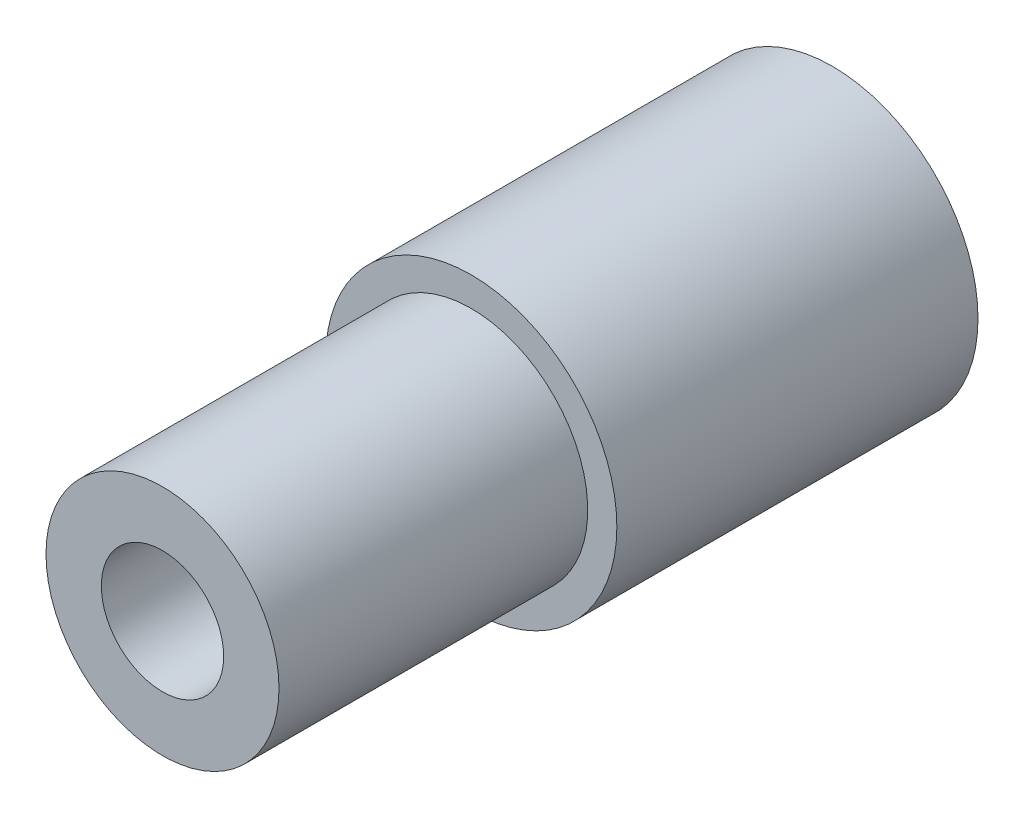
ISO-10303-21;
HEADER;
FILE_DESCRIPTION(('STEP AP214'),'2;1');
FILE_NAME('part.step','',(''),(''),'','','');
FILE_SCHEMA(('AUTOMOTIVE_DESIGN { 1 0 10303 214 1 1 1 1 }'));
ENDSEC;
DATA;
#1=APPLICATION_CONTEXT('core data for automotive mechanical design processes');
#2=APPLICATION_PROTOCOL_DEFINITION('international standard','automotive_design',2000,#1);
#3=PRODUCT_CONTEXT('',#1,'mechanical');
#4=PRODUCT('Part','Part','',(#3));
#5=PRODUCT_RELATED_PRODUCT_CATEGORY('part','',(#4));
#6=PRODUCT_DEFINITION_FORMATION('','',#4);
#7=PRODUCT_DEFINITION_CONTEXT('part definition',#1,'design');
#8=PRODUCT_DEFINITION('design','',#6,#7);
#9=PRODUCT_DEFINITION_SHAPE('','',#8);
#10=(LENGTH_UNIT() NAMED_UNIT(*) SI_UNIT(.MILLI.,.METRE.));
#11=(NAMED_UNIT(*) PLANE_ANGLE_UNIT() SI_UNIT($,.RADIAN.));
#12=(NAMED_UNIT(*) SI_UNIT($,.STERADIAN.) SOLID_ANGLE_UNIT());
#13=UNCERTAINTY_MEASURE_WITH_UNIT(LENGTH_MEASURE(1.E-05),#10,'distance_accuracy_value','');
#14=(GEOMETRIC_REPRESENTATION_CONTEXT(3) GLOBAL_UNCERTAINTY_ASSIGNED_CONTEXT((#13)) GLOBAL_UNIT_ASSIGNED_CONTEXT((#10,
#11,#12)) REPRESENTATION_CONTEXT('',''));
#15=CARTESIAN_POINT('',(0.,0.,0.));
#16=DIRECTION('',(0.,0.,1.));
#17=DIRECTION('',(1.,0.,0.));
#18=AXIS2_PLACEMENT_3D('',#15,#16,#17);
#19=CARTESIAN_POINT('',(0.,0.,23.));
#20=DIRECTION('',(0.,0.,-1.));
#21=DIRECTION('',(-1.,0.,0.));
#22=AXIS2_PLACEMENT_3D('',#19,#20,#21);
#23=CYLINDRICAL_SURFACE('',#22,4.);
#24=CARTESIAN_POINT('',(0.,0.,23.));
#25=DIRECTION('',(0.,0.,1.));
#26=DIRECTION('',(1.,0.,0.));
#27=AXIS2_PLACEMENT_3D('',#24,#25,#26);
#28=CIRCLE('',#27,4.);
#29=CARTESIAN_POINT('',(4.,0.,23.));
#30=VERTEX_POINT('',#29);
#31=EDGE_CURVE('E38',#30,#30,#28,.T.);
#32=ORIENTED_EDGE('',*,*,#31,.F.);
#33=EDGE_LOOP('',(#32));
#34=FACE_BOUND('',#33,.T.);
#35=CARTESIAN_POINT('',(0.,0.,12.4));
#36=DIRECTION('',(0.,0.,-1.));
#37=DIRECTION('',(-1.,0.,0.));
#38=AXIS2_PLACEMENT_3D('',#35,#36,#37);
#39=CIRCLE('',#38,4.);
#40=CARTESIAN_POINT('',(-4.,0.,12.4));
#41=VERTEX_POINT('',#40);
#42=EDGE_CURVE('E10',#41,#41,#39,.T.);
#43=ORIENTED_EDGE('',*,*,#42,.F.);
#44=EDGE_LOOP('',(#43));
#45=FACE_BOUND('',#44,.T.);
#46=ADVANCED_FACE('F32',(#34,#45),#23,.T.);
#47=CARTESIAN_POINT('',(0.,0.,23.));
#48=DIRECTION('',(0.,0.,1.));
#49=DIRECTION('',(1.,0.,0.));
#50=AXIS2_PLACEMENT_3D('',#47,#48,#49);
#51=PLANE('',#50);
#52=ORIENTED_EDGE('',*,*,#31,.T.);
#53=EDGE_LOOP('',(#52));
#54=FACE_BOUND('',#53,.T.);
#55=CARTESIAN_POINT('',(0.,0.,23.));
#56=DIRECTION('',(0.,0.,1.));
#57=DIRECTION('',(1.,0.,0.));
#58=AXIS2_PLACEMENT_3D('',#55,#56,#57);
#59=CIRCLE('',#58,2.1);
#60=CARTESIAN_POINT('',(2.1,0.,23.));
#61=VERTEX_POINT('',#60);
#62=EDGE_CURVE('E42',#61,#61,#59,.T.);
#63=ORIENTED_EDGE('',*,*,#62,.F.);
#64=EDGE_LOOP('',(#63));
#65=FACE_BOUND('',#64,.T.);
#66=ADVANCED_FACE('F70',(#54,#65),#51,.T.);
#67=CARTESIAN_POINT('',(0.,0.,0.));
#68=DIRECTION('',(0.,0.,1.));
#69=DIRECTION('',(1.,0.,0.));
#70=AXIS2_PLACEMENT_3D('',#67,#68,#69);
#71=PLANE('',#70);
#72=CARTESIAN_POINT('',(0.,0.,0.));
#73=DIRECTION('',(0.,0.,1.));
#74=DIRECTION('',(1.,0.,0.));
#75=AXIS2_PLACEMENT_3D('',#72,#73,#74);
#76=CIRCLE('',#75,2.1);
#77=CARTESIAN_POINT('',(2.1,0.,0.));
#78=VERTEX_POINT('',#77);
#79=EDGE_CURVE('E46',#78,#78,#76,.T.);
#80=ORIENTED_EDGE('',*,*,#79,.T.);
#81=EDGE_LOOP('',(#80));
#82=FACE_BOUND('',#81,.T.);
#83=CARTESIAN_POINT('',(0.,0.,0.));
#84=DIRECTION('',(0.,0.,-1.));
#85=DIRECTION('',(-1.,0.,0.));
#86=AXIS2_PLACEMENT_3D('',#83,#84,#85);
#87=CIRCLE('',#86,5.);
#88=CARTESIAN_POINT('',(-5.,0.,0.));
#89=VERTEX_POINT('',#88);
#90=EDGE_CURVE('E52',#89,#89,#87,.T.);
#91=ORIENTED_EDGE('',*,*,#90,.T.);
#92=EDGE_LOOP('',(#91));
#93=FACE_BOUND('',#92,.T.);
#94=ADVANCED_FACE('F75',(#82,#93),#71,.F.);
#95=CARTESIAN_POINT('',(0.,0.,23.));
#96=DIRECTION('',(0.,0.,-1.));
#97=DIRECTION('',(-1.,0.,0.));
#98=AXIS2_PLACEMENT_3D('',#95,#96,#97);
#99=CYLINDRICAL_SURFACE('',#98,2.1);
#100=ORIENTED_EDGE('',*,*,#62,.T.);
#101=EDGE_LOOP('',(#100));
#102=FACE_BOUND('',#101,.T.);
#103=ORIENTED_EDGE('',*,*,#79,.F.);
#104=EDGE_LOOP('',(#103));
#105=FACE_BOUND('',#104,.T.);
#106=ADVANCED_FACE('F67',(#102,#105),#99,.F.);
#107=CARTESIAN_POINT('',(0.,0.,12.4));
#108=DIRECTION('',(0.,0.,-1.));
#109=DIRECTION('',(-1.,0.,0.));
#110=AXIS2_PLACEMENT_3D('',#107,#108,#109);
#111=CYLINDRICAL_SURFACE('',#110,5.);
#112=CARTESIAN_POINT('',(0.,0.,12.4));
#113=DIRECTION('',(0.,0.,-1.));
#114=DIRECTION('',(-1.,0.,0.));
#115=AXIS2_PLACEMENT_3D('',#112,#113,#114);
#116=CIRCLE('',#115,5.);
#117=CARTESIAN_POINT('',(-5.,0.,12.4));
#118=VERTEX_POINT('',#117);
#119=EDGE_CURVE('E50',#118,#118,#116,.T.);
#120=ORIENTED_EDGE('',*,*,#119,.T.);
#121=EDGE_LOOP('',(#120));
#122=FACE_BOUND('',#121,.T.);
#123=ORIENTED_EDGE('',*,*,#90,.F.);
#124=EDGE_LOOP('',(#123));
#125=FACE_BOUND('',#124,.T.);
#126=ADVANCED_FACE('F58',(#122,#125),#111,.T.);
#127=CARTESIAN_POINT('',(0.,0.,12.4));
#128=DIRECTION('',(0.,0.,-1.));
#129=DIRECTION('',(-1.,0.,0.));
#130=AXIS2_PLACEMENT_3D('',#127,#128,#129);
#131=PLANE('',#130);
#132=ORIENTED_EDGE('',*,*,#42,.T.);
#133=EDGE_LOOP('',(#132));
#134=FACE_BOUND('',#133,.T.);
#135=ORIENTED_EDGE('',*,*,#119,.F.);
#136=EDGE_LOOP('',(#135));
#137=FACE_BOUND('',#136,.T.);
#138=ADVANCED_FACE('F61',(#134,#137),#131,.F.);
#139=CLOSED_SHELL('',(#46,#66,#94,#106,#126,#138));
#140=MANIFOLD_SOLID_BREP('B2',#139);
#141=ADVANCED_BREP_SHAPE_REPRESENTATION('',(#18,#140),#14);
#142=SHAPE_DEFINITION_REPRESENTATION(#9,#141);
ENDSEC;
END-ISO-10303-21;
